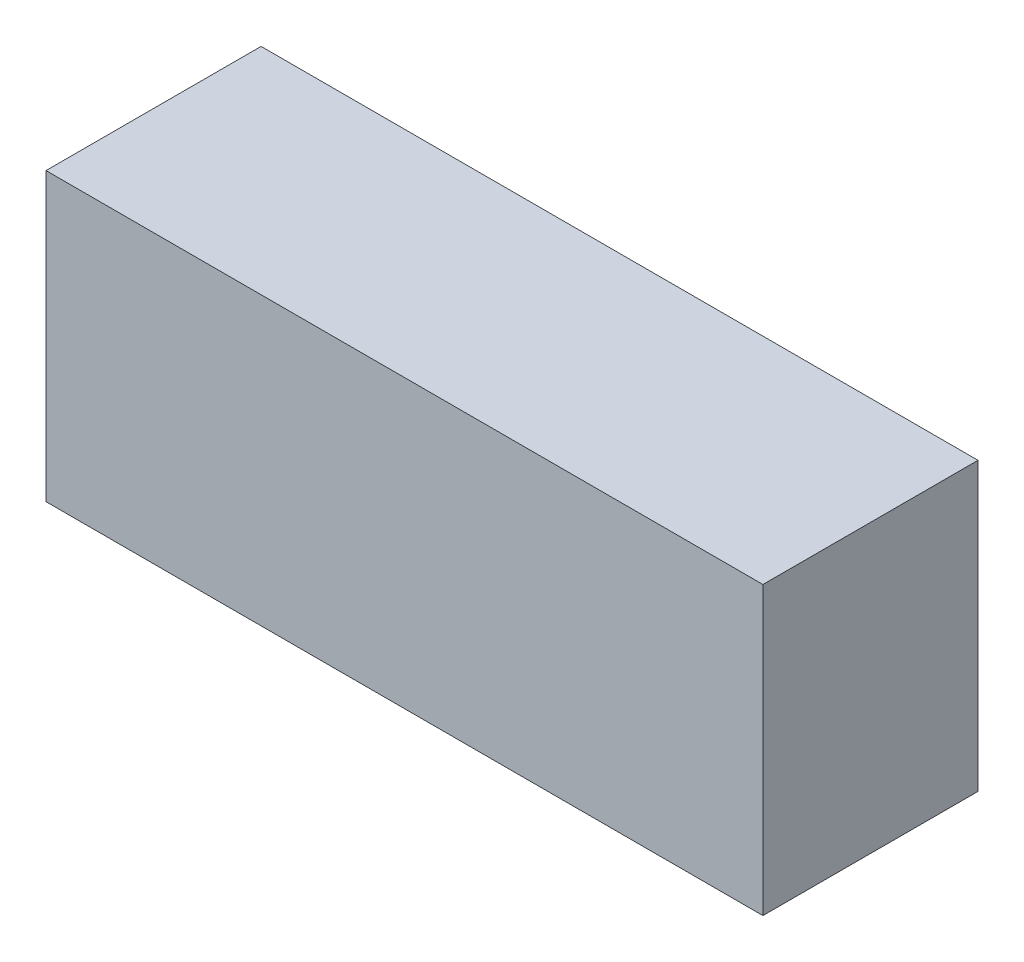
ISO-10303-21;
HEADER;
FILE_DESCRIPTION(('STEP AP214'),'2;1');
FILE_NAME('part.step','',(''),(''),'','','');
FILE_SCHEMA(('AUTOMOTIVE_DESIGN { 1 0 10303 214 1 1 1 1 }'));
ENDSEC;
DATA;
#1=APPLICATION_CONTEXT('core data for automotive mechanical design processes');
#2=APPLICATION_PROTOCOL_DEFINITION('international standard','automotive_design',2000,#1);
#3=PRODUCT_CONTEXT('',#1,'mechanical');
#4=PRODUCT('Part','Part','',(#3));
#5=PRODUCT_RELATED_PRODUCT_CATEGORY('part','',(#4));
#6=PRODUCT_DEFINITION_FORMATION('','',#4);
#7=PRODUCT_DEFINITION_CONTEXT('part definition',#1,'design');
#8=PRODUCT_DEFINITION('design','',#6,#7);
#9=PRODUCT_DEFINITION_SHAPE('','',#8);
#10=(LENGTH_UNIT() NAMED_UNIT(*) SI_UNIT(.MILLI.,.METRE.));
#11=(NAMED_UNIT(*) PLANE_ANGLE_UNIT() SI_UNIT($,.RADIAN.));
#12=(NAMED_UNIT(*) SI_UNIT($,.STERADIAN.) SOLID_ANGLE_UNIT());
#13=UNCERTAINTY_MEASURE_WITH_UNIT(LENGTH_MEASURE(1.E-05),#10,'distance_accuracy_value','');
#14=(GEOMETRIC_REPRESENTATION_CONTEXT(3) GLOBAL_UNCERTAINTY_ASSIGNED_CONTEXT((#13)) GLOBAL_UNIT_ASSIGNED_CONTEXT((#10,
#11,#12)) REPRESENTATION_CONTEXT('',''));
#15=CARTESIAN_POINT('',(0.,0.,0.));
#16=DIRECTION('',(0.,0.,1.));
#17=DIRECTION('',(1.,0.,0.));
#18=AXIS2_PLACEMENT_3D('',#15,#16,#17);
#19=CARTESIAN_POINT('',(0.,0.,3.));
#20=DIRECTION('',(-1.,0.,0.));
#21=DIRECTION('',(0.,-1.,0.));
#22=AXIS2_PLACEMENT_3D('',#19,#20,#21);
#23=PLANE('',#22);
#24=DIRECTION('',(0.,1.,0.));
#25=VECTOR('',#24,1.);
#26=CARTESIAN_POINT('',(0.,0.,0.));
#27=LINE('',#26,#25);
#28=CARTESIAN_POINT('',(0.,-4.,0.));
#29=VERTEX_POINT('',#28);
#30=CARTESIAN_POINT('',(0.,0.,0.));
#31=VERTEX_POINT('',#30);
#32=EDGE_CURVE('E100',#29,#31,#27,.T.);
#33=ORIENTED_EDGE('',*,*,#32,.T.);
#34=DIRECTION('',(0.,0.,-1.));
#35=VECTOR('',#34,1.);
#36=CARTESIAN_POINT('',(0.,0.,3.));
#37=LINE('',#36,#35);
#38=CARTESIAN_POINT('',(0.,0.,3.));
#39=VERTEX_POINT('',#38);
#40=EDGE_CURVE('E11',#39,#31,#37,.T.);
#41=ORIENTED_EDGE('',*,*,#40,.F.);
#42=DIRECTION('',(0.,1.,0.));
#43=VECTOR('',#42,1.);
#44=CARTESIAN_POINT('',(0.,0.,3.));
#45=LINE('',#44,#43);
#46=CARTESIAN_POINT('',(0.,-4.,3.));
#47=VERTEX_POINT('',#46);
#48=EDGE_CURVE('E88',#47,#39,#45,.T.);
#49=ORIENTED_EDGE('',*,*,#48,.F.);
#50=DIRECTION('',(0.,0.,-1.));
#51=VECTOR('',#50,1.);
#52=CARTESIAN_POINT('',(0.,-4.,3.));
#53=LINE('',#52,#51);
#54=EDGE_CURVE('E96',#47,#29,#53,.T.);
#55=ORIENTED_EDGE('',*,*,#54,.T.);
#56=EDGE_LOOP('',(#33,#41,#49,#55));
#57=FACE_BOUND('',#56,.T.);
#58=ADVANCED_FACE('F37',(#57),#23,.F.);
#59=CARTESIAN_POINT('',(0.,0.,3.));
#60=DIRECTION('',(0.,-1.,0.));
#61=DIRECTION('',(0.,0.,-1.));
#62=AXIS2_PLACEMENT_3D('',#59,#60,#61);
#63=PLANE('',#62);
#64=DIRECTION('',(-1.,0.,0.));
#65=VECTOR('',#64,1.);
#66=CARTESIAN_POINT('',(0.,0.,0.));
#67=LINE('',#66,#65);
#68=CARTESIAN_POINT('',(-10.,0.,0.));
#69=VERTEX_POINT('',#68);
#70=EDGE_CURVE('E92',#31,#69,#67,.T.);
#71=ORIENTED_EDGE('',*,*,#70,.T.);
#72=DIRECTION('',(0.,0.,-1.));
#73=VECTOR('',#72,1.);
#74=CARTESIAN_POINT('',(-10.,0.,3.));
#75=LINE('',#74,#73);
#76=CARTESIAN_POINT('',(-10.,0.,3.));
#77=VERTEX_POINT('',#76);
#78=EDGE_CURVE('E45',#77,#69,#75,.T.);
#79=ORIENTED_EDGE('',*,*,#78,.F.);
#80=DIRECTION('',(-1.,0.,0.));
#81=VECTOR('',#80,1.);
#82=CARTESIAN_POINT('',(0.,0.,3.));
#83=LINE('',#82,#81);
#84=EDGE_CURVE('E83',#39,#77,#83,.T.);
#85=ORIENTED_EDGE('',*,*,#84,.F.);
#86=ORIENTED_EDGE('',*,*,#40,.T.);
#87=EDGE_LOOP('',(#71,#79,#85,#86));
#88=FACE_BOUND('',#87,.T.);
#89=ADVANCED_FACE('F91',(#88),#63,.F.);
#90=CARTESIAN_POINT('',(-10.,0.,3.));
#91=DIRECTION('',(1.,0.,0.));
#92=DIRECTION('',(0.,1.,0.));
#93=AXIS2_PLACEMENT_3D('',#90,#91,#92);
#94=PLANE('',#93);
#95=DIRECTION('',(0.,-1.,0.));
#96=VECTOR('',#95,1.);
#97=CARTESIAN_POINT('',(-10.,0.,0.));
#98=LINE('',#97,#96);
#99=CARTESIAN_POINT('',(-10.,-4.,0.));
#100=VERTEX_POINT('',#99);
#101=EDGE_CURVE('E70',#69,#100,#98,.T.);
#102=ORIENTED_EDGE('',*,*,#101,.T.);
#103=DIRECTION('',(0.,0.,-1.));
#104=VECTOR('',#103,1.);
#105=CARTESIAN_POINT('',(-10.,-4.,3.));
#106=LINE('',#105,#104);
#107=CARTESIAN_POINT('',(-10.,-4.,3.));
#108=VERTEX_POINT('',#107);
#109=EDGE_CURVE('E93',#108,#100,#106,.T.);
#110=ORIENTED_EDGE('',*,*,#109,.F.);
#111=DIRECTION('',(0.,-1.,0.));
#112=VECTOR('',#111,1.);
#113=CARTESIAN_POINT('',(-10.,0.,3.));
#114=LINE('',#113,#112);
#115=EDGE_CURVE('E86',#77,#108,#114,.T.);
#116=ORIENTED_EDGE('',*,*,#115,.F.);
#117=ORIENTED_EDGE('',*,*,#78,.T.);
#118=EDGE_LOOP('',(#102,#110,#116,#117));
#119=FACE_BOUND('',#118,.T.);
#120=ADVANCED_FACE('F94',(#119),#94,.F.);
#121=CARTESIAN_POINT('',(0.,-4.,3.));
#122=DIRECTION('',(0.,1.,0.));
#123=DIRECTION('',(-1.,0.,0.));
#124=AXIS2_PLACEMENT_3D('',#121,#122,#123);
#125=PLANE('',#124);
#126=DIRECTION('',(1.,0.,0.));
#127=VECTOR('',#126,1.);
#128=CARTESIAN_POINT('',(0.,-4.,0.));
#129=LINE('',#128,#127);
#130=EDGE_CURVE('E76',#100,#29,#129,.T.);
#131=ORIENTED_EDGE('',*,*,#130,.T.);
#132=ORIENTED_EDGE('',*,*,#54,.F.);
#133=DIRECTION('',(1.,0.,0.));
#134=VECTOR('',#133,1.);
#135=CARTESIAN_POINT('',(0.,-4.,3.));
#136=LINE('',#135,#134);
#137=EDGE_CURVE('E53',#108,#47,#136,.T.);
#138=ORIENTED_EDGE('',*,*,#137,.F.);
#139=ORIENTED_EDGE('',*,*,#109,.T.);
#140=EDGE_LOOP('',(#131,#132,#138,#139));
#141=FACE_BOUND('',#140,.T.);
#142=ADVANCED_FACE('F107',(#141),#125,.F.);
#143=CARTESIAN_POINT('',(0.,0.,3.));
#144=DIRECTION('',(0.,0.,-1.));
#145=DIRECTION('',(-1.,0.,0.));
#146=AXIS2_PLACEMENT_3D('',#143,#144,#145);
#147=PLANE('',#146);
#148=ORIENTED_EDGE('',*,*,#48,.T.);
#149=ORIENTED_EDGE('',*,*,#84,.T.);
#150=ORIENTED_EDGE('',*,*,#115,.T.);
#151=ORIENTED_EDGE('',*,*,#137,.T.);
#152=EDGE_LOOP('',(#148,#149,#150,#151));
#153=FACE_BOUND('',#152,.T.);
#154=ADVANCED_FACE('F84',(#153),#147,.F.);
#155=CARTESIAN_POINT('',(0.,0.,0.));
#156=DIRECTION('',(0.,0.,-1.));
#157=DIRECTION('',(-1.,0.,0.));
#158=AXIS2_PLACEMENT_3D('',#155,#156,#157);
#159=PLANE('',#158);
#160=ORIENTED_EDGE('',*,*,#32,.F.);
#161=ORIENTED_EDGE('',*,*,#130,.F.);
#162=ORIENTED_EDGE('',*,*,#101,.F.);
#163=ORIENTED_EDGE('',*,*,#70,.F.);
#164=EDGE_LOOP('',(#160,#161,#162,#163));
#165=FACE_BOUND('',#164,.T.);
#166=ADVANCED_FACE('F110',(#165),#159,.T.);
#167=CLOSED_SHELL('',(#58,#89,#120,#142,#154,#166));
#168=MANIFOLD_SOLID_BREP('B2',#167);
#169=ADVANCED_BREP_SHAPE_REPRESENTATION('',(#18,#168),#14);
#170=SHAPE_DEFINITION_REPRESENTATION(#9,#169);
ENDSEC;
END-ISO-10303-21;
